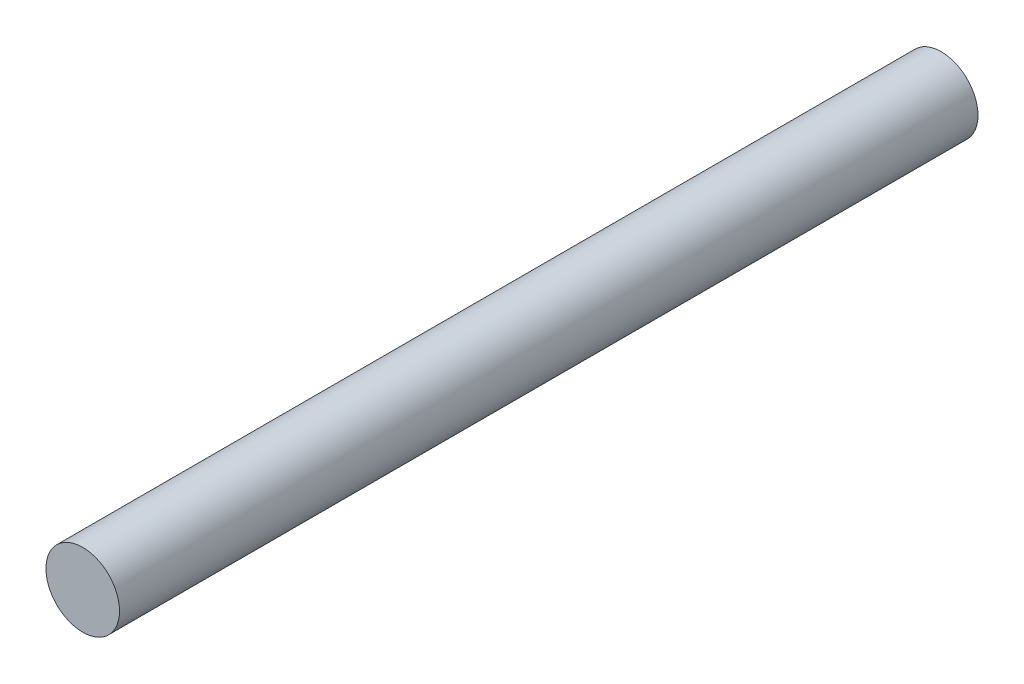
ISO-10303-21;
HEADER;
FILE_DESCRIPTION(('STEP AP214'),'2;1');
FILE_NAME('part.step','',(''),(''),'','','');
FILE_SCHEMA(('AUTOMOTIVE_DESIGN { 1 0 10303 214 1 1 1 1 }'));
ENDSEC;
DATA;
#1=APPLICATION_CONTEXT('core data for automotive mechanical design processes');
#2=APPLICATION_PROTOCOL_DEFINITION('international standard','automotive_design',2000,#1);
#3=PRODUCT_CONTEXT('',#1,'mechanical');
#4=PRODUCT('Part','Part','',(#3));
#5=PRODUCT_RELATED_PRODUCT_CATEGORY('part','',(#4));
#6=PRODUCT_DEFINITION_FORMATION('','',#4);
#7=PRODUCT_DEFINITION_CONTEXT('part definition',#1,'design');
#8=PRODUCT_DEFINITION('design','',#6,#7);
#9=PRODUCT_DEFINITION_SHAPE('','',#8);
#10=(LENGTH_UNIT() NAMED_UNIT(*) SI_UNIT(.MILLI.,.METRE.));
#11=(NAMED_UNIT(*) PLANE_ANGLE_UNIT() SI_UNIT($,.RADIAN.));
#12=(NAMED_UNIT(*) SI_UNIT($,.STERADIAN.) SOLID_ANGLE_UNIT());
#13=UNCERTAINTY_MEASURE_WITH_UNIT(LENGTH_MEASURE(1.E-05),#10,'distance_accuracy_value','');
#14=(GEOMETRIC_REPRESENTATION_CONTEXT(3) GLOBAL_UNCERTAINTY_ASSIGNED_CONTEXT((#13)) GLOBAL_UNIT_ASSIGNED_CONTEXT((#10,
#11,#12)) REPRESENTATION_CONTEXT('',''));
#15=CARTESIAN_POINT('',(0.,0.,0.));
#16=DIRECTION('',(0.,0.,1.));
#17=DIRECTION('',(1.,0.,0.));
#18=AXIS2_PLACEMENT_3D('',#15,#16,#17);
#19=CARTESIAN_POINT('',(0.,0.,70.));
#20=DIRECTION('',(0.,0.,-1.));
#21=DIRECTION('',(-1.,0.,0.));
#22=AXIS2_PLACEMENT_3D('',#19,#20,#21);
#23=CYLINDRICAL_SURFACE('',#22,3.);
#24=CARTESIAN_POINT('',(0.,0.,70.));
#25=DIRECTION('',(0.,0.,1.));
#26=DIRECTION('',(1.,0.,0.));
#27=AXIS2_PLACEMENT_3D('',#24,#25,#26);
#28=CIRCLE('',#27,3.);
#29=CARTESIAN_POINT('',(3.,0.,70.));
#30=VERTEX_POINT('',#29);
#31=EDGE_CURVE('E10',#30,#30,#28,.T.);
#32=ORIENTED_EDGE('',*,*,#31,.F.);
#33=EDGE_LOOP('',(#32));
#34=FACE_BOUND('',#33,.T.);
#35=CARTESIAN_POINT('',(0.,0.,0.));
#36=DIRECTION('',(0.,0.,1.));
#37=DIRECTION('',(1.,0.,0.));
#38=AXIS2_PLACEMENT_3D('',#35,#36,#37);
#39=CIRCLE('',#38,3.);
#40=CARTESIAN_POINT('',(3.,0.,0.));
#41=VERTEX_POINT('',#40);
#42=EDGE_CURVE('E40',#41,#41,#39,.T.);
#43=ORIENTED_EDGE('',*,*,#42,.T.);
#44=EDGE_LOOP('',(#43));
#45=FACE_BOUND('',#44,.T.);
#46=ADVANCED_FACE('F37',(#34,#45),#23,.T.);
#47=CARTESIAN_POINT('',(0.,0.,70.));
#48=DIRECTION('',(0.,0.,1.));
#49=DIRECTION('',(1.,0.,0.));
#50=AXIS2_PLACEMENT_3D('',#47,#48,#49);
#51=PLANE('',#50);
#52=ORIENTED_EDGE('',*,*,#31,.T.);
#53=EDGE_LOOP('',(#52));
#54=FACE_BOUND('',#53,.T.);
#55=ADVANCED_FACE('F54',(#54),#51,.T.);
#56=CARTESIAN_POINT('',(0.,0.,0.));
#57=DIRECTION('',(0.,0.,1.));
#58=DIRECTION('',(1.,0.,0.));
#59=AXIS2_PLACEMENT_3D('',#56,#57,#58);
#60=PLANE('',#59);
#61=ORIENTED_EDGE('',*,*,#42,.F.);
#62=EDGE_LOOP('',(#61));
#63=FACE_BOUND('',#62,.T.);
#64=ADVANCED_FACE('F52',(#63),#60,.F.);
#65=CLOSED_SHELL('',(#46,#55,#64));
#66=MANIFOLD_SOLID_BREP('B2',#65);
#67=ADVANCED_BREP_SHAPE_REPRESENTATION('',(#18,#66),#14);
#68=SHAPE_DEFINITION_REPRESENTATION(#9,#67);
ENDSEC;
END-ISO-10303-21;
